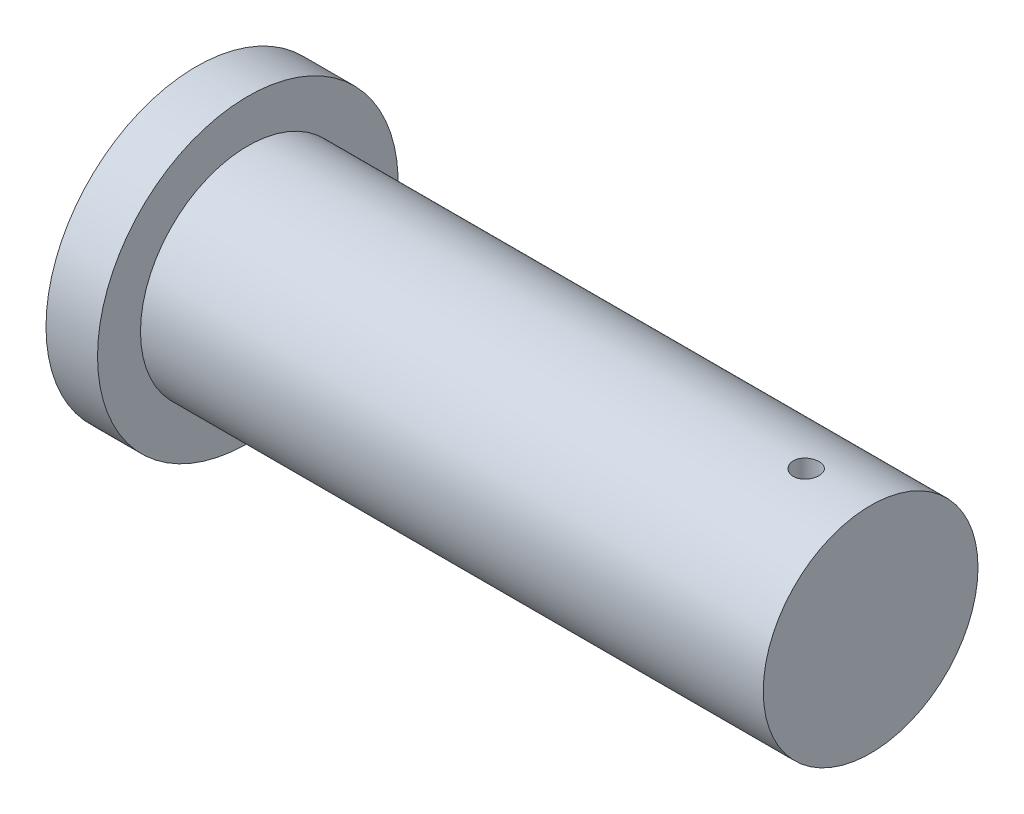
ISO-10303-21;
HEADER;
FILE_DESCRIPTION(('STEP AP214'),'2;1');
FILE_NAME('part.step','',(''),(''),'','','');
FILE_SCHEMA(('AUTOMOTIVE_DESIGN { 1 0 10303 214 1 1 1 1 }'));
ENDSEC;
DATA;
#1=APPLICATION_CONTEXT('core data for automotive mechanical design processes');
#2=APPLICATION_PROTOCOL_DEFINITION('international standard','automotive_design',2000,#1);
#3=PRODUCT_CONTEXT('',#1,'mechanical');
#4=PRODUCT('Part','Part','',(#3));
#5=PRODUCT_RELATED_PRODUCT_CATEGORY('part','',(#4));
#6=PRODUCT_DEFINITION_FORMATION('','',#4);
#7=PRODUCT_DEFINITION_CONTEXT('part definition',#1,'design');
#8=PRODUCT_DEFINITION('design','',#6,#7);
#9=PRODUCT_DEFINITION_SHAPE('','',#8);
#10=(LENGTH_UNIT() NAMED_UNIT(*) SI_UNIT(.MILLI.,.METRE.));
#11=(NAMED_UNIT(*) PLANE_ANGLE_UNIT() SI_UNIT($,.RADIAN.));
#12=(NAMED_UNIT(*) SI_UNIT($,.STERADIAN.) SOLID_ANGLE_UNIT());
#13=UNCERTAINTY_MEASURE_WITH_UNIT(LENGTH_MEASURE(1.E-05),#10,'distance_accuracy_value','');
#14=(GEOMETRIC_REPRESENTATION_CONTEXT(3) GLOBAL_UNCERTAINTY_ASSIGNED_CONTEXT((#13)) GLOBAL_UNIT_ASSIGNED_CONTEXT((#10,
#11,#12)) REPRESENTATION_CONTEXT('',''));
#15=CARTESIAN_POINT('',(0.,0.,0.));
#16=DIRECTION('',(0.,0.,1.));
#17=DIRECTION('',(1.,0.,0.));
#18=AXIS2_PLACEMENT_3D('',#15,#16,#17);
#19=CARTESIAN_POINT('',(0.,0.,0.));
#20=DIRECTION('',(-1.,0.,0.));
#21=DIRECTION('',(0.,0.,1.));
#22=AXIS2_PLACEMENT_3D('',#19,#20,#21);
#23=PLANE('',#22);
#24=CARTESIAN_POINT('',(0.,0.,0.));
#25=DIRECTION('',(-1.,0.,0.));
#26=DIRECTION('',(0.,0.,1.));
#27=AXIS2_PLACEMENT_3D('',#24,#25,#26);
#28=CIRCLE('',#27,250.);
#29=CARTESIAN_POINT('',(0.,0.,250.));
#30=VERTEX_POINT('',#29);
#31=EDGE_CURVE('E10',#30,#30,#28,.T.);
#32=ORIENTED_EDGE('',*,*,#31,.F.);
#33=EDGE_LOOP('',(#32));
#34=FACE_BOUND('',#33,.T.);
#35=ADVANCED_FACE('F37',(#34),#23,.F.);
#36=CARTESIAN_POINT('',(-1570.,0.,0.));
#37=DIRECTION('',(-1.,0.,0.));
#38=DIRECTION('',(0.,0.,1.));
#39=AXIS2_PLACEMENT_3D('',#36,#37,#38);
#40=CYLINDRICAL_SURFACE('',#39,250.);
#41=CARTESIAN_POINT('',(-150.,-248.193472919817,30.));
#42=CARTESIAN_POINT('',(-149.1605704413,-248.193474531631,29.9999946509676));
#43=CARTESIAN_POINT('',(-148.320999975533,-248.197743080728,29.9647376822216));
#44=CARTESIAN_POINT('',(-146.647741109354,-248.214699920192,29.8239438039664));
#45=CARTESIAN_POINT('',(-145.814054103793,-248.2273901436,29.7183907592619));
#46=CARTESIAN_POINT('',(-144.157803445657,-248.260840976248,29.437643248266));
#47=CARTESIAN_POINT('',(-143.335251360894,-248.28160939787,29.2623813632194));
#48=CARTESIAN_POINT('',(-141.708019820902,-248.330617331352,28.8435242149326));
#49=CARTESIAN_POINT('',(-140.903339348547,-248.358856416848,28.5999328513345));
#50=CARTESIAN_POINT('',(-139.317998086867,-248.421976036118,28.0463777739689));
#51=CARTESIAN_POINT('',(-138.53732207594,-248.456852255905,27.7364571564889));
#52=CARTESIAN_POINT('',(-137.004911431408,-248.532264669028,27.0523889546609));
#53=CARTESIAN_POINT('',(-136.253177185404,-248.572800938131,26.6782405105099));
#54=CARTESIAN_POINT('',(-134.784038367413,-248.658375561636,25.8684731554346));
#55=CARTESIAN_POINT('',(-134.066627306623,-248.703413060068,25.4328659252837));
#56=CARTESIAN_POINT('',(-132.6709543014,-248.796726113069,24.5032084370155));
#57=CARTESIAN_POINT('',(-131.992692378886,-248.845001669451,24.0091581461777));
#58=CARTESIAN_POINT('',(-130.676969930708,-248.943662426129,22.9636627490856));
#59=CARTESIAN_POINT('',(-130.039712237698,-248.994056337376,22.4119631888764));
#60=CARTESIAN_POINT('',(-128.813877743625,-249.095320238186,21.2569381320288));
#61=CARTESIAN_POINT('',(-128.225301123888,-249.146190229521,20.6536124431132));
#62=CARTESIAN_POINT('',(-127.100916607426,-249.24697467363,19.3995169953124));
#63=CARTESIAN_POINT('',(-126.565111252273,-249.296889080287,18.7487449539387));
#64=CARTESIAN_POINT('',(-125.550068542811,-249.394354081313,17.4043184562741));
#65=CARTESIAN_POINT('',(-125.070831226376,-249.441904674099,16.7106639712729));
#66=CARTESIAN_POINT('',(-124.170950368469,-249.533442144995,15.283136535881));
#67=CARTESIAN_POINT('',(-123.750490049984,-249.577417708061,14.5491473403797));
#68=CARTESIAN_POINT('',(-122.972931747199,-249.6603951477,13.0480665588376));
#69=CARTESIAN_POINT('',(-122.615833933811,-249.699397010857,12.2809748835136));
#70=CARTESIAN_POINT('',(-121.967613733338,-249.771317118663,10.7191496279362));
#71=CARTESIAN_POINT('',(-121.67648957869,-249.804235526295,9.92441678890158));
#72=CARTESIAN_POINT('',(-121.162352645447,-249.863051734217,8.31296355266619));
#73=CARTESIAN_POINT('',(-120.9393395157,-249.888949570703,7.49624326884762));
#74=CARTESIAN_POINT('',(-120.563993792491,-249.932878697725,5.8506665836714));
#75=CARTESIAN_POINT('',(-120.411324978212,-249.950947383566,5.02188786360801));
#76=CARTESIAN_POINT('',(-120.17622148034,-249.978887329081,3.35429051231377));
#77=CARTESIAN_POINT('',(-120.093786593924,-249.988758612427,2.5154719100833));
#78=CARTESIAN_POINT('',(-119.999768971145,-250.000023346581,0.833843716313003));
#79=CARTESIAN_POINT('',(-119.988183947642,-250.001417071057,-0.00896574551689192));
#80=CARTESIAN_POINT('',(-120.035946972574,-249.995687792436,-1.69254185793251));
#81=CARTESIAN_POINT('',(-120.095294826074,-249.988564812744,-2.53330851412584));
#82=CARTESIAN_POINT('',(-120.283990236561,-249.966062777657,-4.20244453023435));
#83=CARTESIAN_POINT('',(-120.412975601989,-249.950726444014,-5.03085544328965));
#84=CARTESIAN_POINT('',(-120.73975635101,-249.9122557387,-6.67380360362));
#85=CARTESIAN_POINT('',(-120.93755145992,-249.889121398159,-7.48834090626358));
#86=CARTESIAN_POINT('',(-121.40050574512,-249.83570252719,-9.09780852968847));
#87=CARTESIAN_POINT('',(-121.665665751094,-249.805417908697,-9.89273860884935));
#88=CARTESIAN_POINT('',(-122.261425636984,-249.738545201862,-11.4574117372028));
#89=CARTESIAN_POINT('',(-122.59202576275,-249.701957089838,-12.2271546917577));
#90=CARTESIAN_POINT('',(-123.317195071912,-249.623400157603,-13.7379683316622));
#91=CARTESIAN_POINT('',(-123.711921271942,-249.581418184343,-14.4789629635211));
#92=CARTESIAN_POINT('',(-124.561941982507,-249.493318926867,-15.9250956040533));
#93=CARTESIAN_POINT('',(-125.017236556642,-249.447201638309,-16.6302335750746));
#94=CARTESIAN_POINT('',(-125.985201132959,-249.352117841448,-17.9997951231493));
#95=CARTESIAN_POINT('',(-126.497873181545,-249.303151231553,-18.664217246737));
#96=CARTESIAN_POINT('',(-127.576998276152,-249.203736816779,-19.9477312714738));
#97=CARTESIAN_POINT('',(-128.143451560363,-249.153289005341,-20.5668229718397));
#98=CARTESIAN_POINT('',(-129.329940664582,-249.052002372002,-21.7591461132143));
#99=CARTESIAN_POINT('',(-129.950291858021,-249.001163090519,-22.3320637323763));
#100=CARTESIAN_POINT('',(-131.23713401272,-248.900851276313,-23.4236363437972));
#101=CARTESIAN_POINT('',(-131.903625179866,-248.851378749691,-23.9422910938981));
#102=CARTESIAN_POINT('',(-133.278087670693,-248.755205933452,-24.9216719052182));
#103=CARTESIAN_POINT('',(-133.986059213002,-248.708505658448,-25.3823976610738));
#104=CARTESIAN_POINT('',(-135.438514856123,-248.619209908325,-26.2426285291918));
#105=CARTESIAN_POINT('',(-136.18299889198,-248.576614425904,-26.6421337503589));
#106=CARTESIAN_POINT('',(-137.703527308154,-248.496733797357,-27.3771821116765));
#107=CARTESIAN_POINT('',(-138.47958355691,-248.459450672381,-27.7127009237719));
#108=CARTESIAN_POINT('',(-140.057489994014,-248.391288696872,-28.3171374504508));
#109=CARTESIAN_POINT('',(-140.859340207393,-248.360409852555,-28.5860551003969));
#110=CARTESIAN_POINT('',(-142.483080291291,-248.305951958708,-29.0552932977666));
#111=CARTESIAN_POINT('',(-143.304969434112,-248.282372644526,-29.255616332184));
#112=CARTESIAN_POINT('',(-144.96290865867,-248.243198383256,-29.5861827187821));
#113=CARTESIAN_POINT('',(-145.798958662777,-248.227603392413,-29.716426455005));
#114=CARTESIAN_POINT('',(-147.473953016257,-248.204923432622,-29.9052668310815));
#115=CARTESIAN_POINT('',(-148.312846991056,-248.197786118229,-29.9643042155057));
#116=CARTESIAN_POINT('',(-149.992657619704,-248.192051927075,-30.0117633896308));
#117=CARTESIAN_POINT('',(-150.8335742652,-248.193455015103,-30.0001854704649));
#118=CARTESIAN_POINT('',(-152.511395065306,-248.204760956533,-29.9065018038126));
#119=CARTESIAN_POINT('',(-153.348299294855,-248.214663650566,-29.8243973787052));
#120=CARTESIAN_POINT('',(-155.012129982595,-248.242682732508,-29.5902743976899));
#121=CARTESIAN_POINT('',(-155.839056445804,-248.260799116285,-29.4382558769449));
#122=CARTESIAN_POINT('',(-157.474502965534,-248.304655640846,-29.0660101429271));
#123=CARTESIAN_POINT('',(-158.283072119113,-248.330371983227,-28.8459957539828));
#124=CARTESIAN_POINT('',(-159.878751686147,-248.388715473606,-28.3392134881515));
#125=CARTESIAN_POINT('',(-160.665862159057,-248.421342602454,-28.0524457962345));
#126=CARTESIAN_POINT('',(-162.213143298547,-248.492582429562,-27.4142208538501));
#127=CARTESIAN_POINT('',(-162.973313286559,-248.531195278457,-27.062761975343));
#128=CARTESIAN_POINT('',(-164.461416251638,-248.613315286474,-26.2976691995083));
#129=CARTESIAN_POINT('',(-165.189349066541,-248.656822470213,-25.8840349894648));
#130=CARTESIAN_POINT('',(-166.611408771142,-248.747729364898,-24.9953500062539));
#131=CARTESIAN_POINT('',(-167.305353560671,-248.795147017641,-24.5200096625206));
#132=CARTESIAN_POINT('',(-168.650792269959,-248.892349734088,-23.5128496840407));
#133=CARTESIAN_POINT('',(-169.302286068319,-248.94213480456,-22.9810298877921));
#134=CARTESIAN_POINT('',(-170.558322824153,-249.042672336284,-21.8646149255231));
#135=CARTESIAN_POINT('',(-171.162864296291,-249.093424828075,-21.2800180911685));
#136=CARTESIAN_POINT('',(-172.320773332466,-249.194470611332,-20.0621306020361));
#137=CARTESIAN_POINT('',(-172.874140753962,-249.244763901518,-19.4288398116353));
#138=CARTESIAN_POINT('',(-173.928599123128,-249.343740229315,-18.1145159166704));
#139=CARTESIAN_POINT('',(-174.429400510761,-249.392413432178,-17.433249721657));
#140=CARTESIAN_POINT('',(-175.371826218618,-249.486491898318,-16.0307281687418));
#141=CARTESIAN_POINT('',(-175.813450300065,-249.531897148409,-15.3094726495014));
#142=CARTESIAN_POINT('',(-176.634344274995,-249.618151591168,-13.8320586111139));
#143=CARTESIAN_POINT('',(-177.013614990501,-249.659000843896,-13.0759005522647));
#144=CARTESIAN_POINT('',(-177.707054443502,-249.734983564515,-11.5340229887521));
#145=CARTESIAN_POINT('',(-178.021223433973,-249.770117054615,-10.7483035989737));
#146=CARTESIAN_POINT('',(-178.581451853234,-249.833588745784,-9.15489098903917));
#147=CARTESIAN_POINT('',(-178.827679671532,-249.861943723365,-8.34725764502255));
#148=CARTESIAN_POINT('',(-179.251245916454,-249.911166395072,-6.71389777364353));
#149=CARTESIAN_POINT('',(-179.428584416741,-249.932034097204,-5.88817126562875));
#150=CARTESIAN_POINT('',(-179.713045056139,-249.965687778844,-4.22457629840832));
#151=CARTESIAN_POINT('',(-179.820169630992,-249.9784740387,-3.38670826142659));
#152=CARTESIAN_POINT('',(-179.96340788777,-249.99560143016,-1.70483954433616));
#153=CARTESIAN_POINT('',(-179.999521891187,-249.999942599999,-0.860838892009534));
#154=CARTESIAN_POINT('',(-180.000465701341,-250.000055910935,0.821891060714141));
#155=CARTESIAN_POINT('',(-179.965742246484,-249.995881754181,1.66062014165989));
#156=CARTESIAN_POINT('',(-179.826166823084,-249.979190014585,3.33213559205108));
#157=CARTESIAN_POINT('',(-179.721315169328,-249.966672469195,4.16492198815463));
#158=CARTESIAN_POINT('',(-179.442260953022,-249.933646334168,5.81862750164886));
#159=CARTESIAN_POINT('',(-179.268058587309,-249.913137767213,6.63954665271501));
#160=CARTESIAN_POINT('',(-178.85158524623,-249.86470587868,8.26370804760723));
#161=CARTESIAN_POINT('',(-178.609314148308,-249.836782543753,9.06695025960339));
#162=CARTESIAN_POINT('',(-178.058554843599,-249.774313586065,10.6498604352753));
#163=CARTESIAN_POINT('',(-177.750086724313,-249.739769972569,11.4295354687165));
#164=CARTESIAN_POINT('',(-177.069115802718,-249.665020719012,12.960114678435));
#165=CARTESIAN_POINT('',(-176.696613049426,-249.624815083284,13.7110188767354));
#166=CARTESIAN_POINT('',(-175.890228843372,-249.539863095647,15.1788419699795));
#167=CARTESIAN_POINT('',(-175.456347346031,-249.495116740438,15.8957608402394));
#168=CARTESIAN_POINT('',(-174.530265194195,-249.402329067066,17.2906605810802));
#169=CARTESIAN_POINT('',(-174.038064289256,-249.354287734752,17.9686412844272));
#170=CARTESIAN_POINT('',(-172.995639159189,-249.255950077794,19.2849594194555));
#171=CARTESIAN_POINT('',(-172.445082438354,-249.205641885906,19.923032680102));
#172=CARTESIAN_POINT('',(-171.292280176236,-249.104459244391,21.1505976868385));
#173=CARTESIAN_POINT('',(-170.690034250122,-249.053584790551,21.7400890711682));
#174=CARTESIAN_POINT('',(-169.437907579956,-248.952691992913,22.8665055592455));
#175=CARTESIAN_POINT('',(-168.788015340804,-248.902673859324,23.4034179043673));
#176=CARTESIAN_POINT('',(-167.44526388913,-248.804921545612,24.4207336954875));
#177=CARTESIAN_POINT('',(-166.752405246466,-248.757187335214,24.9011378907015));
#178=CARTESIAN_POINT('',(-165.326017000733,-248.665193713503,25.8036432950789));
#179=CARTESIAN_POINT('',(-164.592351663176,-248.620947248293,26.2255313287722));
#180=CARTESIAN_POINT('',(-163.091732249698,-248.537386184943,27.0059583921024));
#181=CARTESIAN_POINT('',(-162.324776130025,-248.498071890171,27.3644935255784));
#182=CARTESIAN_POINT('',(-160.763871473165,-248.425549653007,28.0152351882781));
#183=CARTESIAN_POINT('',(-159.969950899548,-248.392335600441,28.3075081571224));
#184=CARTESIAN_POINT('',(-158.36013899519,-248.332932727422,28.8239875750066));
#185=CARTESIAN_POINT('',(-157.544252946941,-248.306742234185,29.0482102331036));
#186=CARTESIAN_POINT('',(-156.16999327754,-248.269542249127,29.3640997551931));
#187=CARTESIAN_POINT('',(-155.616030955531,-248.256379293141,29.4750618477914));
#188=CARTESIAN_POINT('',(-154.502667838974,-248.233689152617,29.6655497040171));
#189=CARTESIAN_POINT('',(-153.943267497728,-248.224161667652,29.7450780652627));
#190=CARTESIAN_POINT('',(-152.82076790437,-248.208867224382,29.8724346728726));
#191=CARTESIAN_POINT('',(-152.257668326194,-248.203100602191,29.9202600859007));
#192=CARTESIAN_POINT('',(-151.129733640302,-248.195403114445,29.9840428305316));
#193=CARTESIAN_POINT('',(-150.564898726378,-248.193471835138,30.0000035996607));
#194=CARTESIAN_POINT('',(-150.,-248.193472919817,30.));
#195=B_SPLINE_CURVE_WITH_KNOTS('',3,(#41,#42,#43,#44,#45,#46,#47,#48,#49,#50,#51,#52,#53,#54,
#55,#56,#57,#58,#59,#60,#61,#62,#63,#64,#65,#66,#67,#68,#69,#70,#71,#72,#73,#74,#75,#76,#77,#78,
#79,#80,#81,#82,#83,#84,#85,#86,#87,#88,#89,#90,#91,#92,#93,#94,#95,#96,#97,#98,#99,#100,#101,
#102,#103,#104,#105,#106,#107,#108,#109,#110,#111,#112,#113,#114,#115,#116,#117,#118,#119,#120,
#121,#122,#123,#124,#125,#126,#127,#128,#129,#130,#131,#132,#133,#134,#135,#136,#137,#138,#139,
#140,#141,#142,#143,#144,#145,#146,#147,#148,#149,#150,#151,#152,#153,#154,#155,#156,#157,#158,
#159,#160,#161,#162,#163,#164,#165,#166,#167,#168,#169,#170,#171,#172,#173,#174,#175,#176,#177,
#178,#179,#180,#181,#182,#183,#184,#185,#186,#187,#188,#189,#190,#191,#192,#193,#194),
.UNSPECIFIED.,.T.,.F.,(4,2,2,2,2,2,2,2,2,2,2,2,2,2,2,2,2,2,2,2,2,2,2,2,2,2,2,2,2,2,2,2,2,2,2,2,
2,2,2,2,2,2,2,2,2,2,2,2,2,2,2,2,2,2,2,2,2,2,2,2,2,2,2,2,2,2,2,2,2,2,2,2,2,2,2,2,4),(0.,
2.51778336120787,5.03614483340464,7.5569478791578,10.0776070890421,12.5966334893289,
15.1156936138648,17.6342756125914,20.1528590213977,22.6830704251219,25.2132912528273,
27.7436338815808,30.2739782044391,32.8120422932015,35.3501132279974,37.8881161549024,
40.4261059966501,42.9518359963828,45.4775587022602,48.0031998736002,50.5288341040817,
53.0414570607044,55.5540699872896,58.0667138614276,60.5793671754447,63.0982682651093,
65.6171719997426,68.1361656013437,70.6551703597175,73.190060359931,75.7249616720726,
78.2598763459937,80.7947865105238,83.3306585515194,85.8665330536023,88.4023156042651,
90.9380842584261,93.4580754143531,95.9780561808548,98.4979896984996,101.017921948763,
103.530045452468,106.042161995283,108.554341767491,111.06653417533,113.590973306469,
116.115419656387,118.639945834501,121.164479044206,123.702259810315,126.240050815944,
128.777808362505,131.315556047529,133.846956344173,136.378353934039,138.909663704341,
141.440962014409,143.956345976335,146.471718647479,148.987084179392,151.502454240218,
154.017062088027,156.531668010964,159.046275760263,161.560894308643,164.090700724772,
166.620525977165,169.150963593885,171.681367656906,174.220760623165,176.760309706082,
179.297301064822,181.833687656739,183.528215248704,185.222602779138,186.91714171891,
188.611497843615),.UNSPECIFIED.);
#196=CARTESIAN_POINT('',(-150.,-248.193472919817,30.));
#197=VERTEX_POINT('',#196);
#198=EDGE_CURVE('E40',#197,#197,#195,.T.);
#199=ORIENTED_EDGE('',*,*,#198,.T.);
#200=EDGE_LOOP('',(#199));
#201=FACE_BOUND('',#200,.T.);
#202=CARTESIAN_POINT('',(-150.,248.193472919817,30.));
#203=CARTESIAN_POINT('',(-150.8394295587,248.193474531631,29.9999946509676));
#204=CARTESIAN_POINT('',(-151.679000024467,248.197743080728,29.9647376822216));
#205=CARTESIAN_POINT('',(-153.352258890646,248.214699920192,29.8239438039664));
#206=CARTESIAN_POINT('',(-154.185945896208,248.2273901436,29.7183907592619));
#207=CARTESIAN_POINT('',(-155.842196554343,248.260840976248,29.437643248266));
#208=CARTESIAN_POINT('',(-156.664748639107,248.28160939787,29.2623813632194));
#209=CARTESIAN_POINT('',(-158.291980179099,248.330617331352,28.8435242149326));
#210=CARTESIAN_POINT('',(-159.096660651453,248.358856416848,28.5999328513345));
#211=CARTESIAN_POINT('',(-160.682001913133,248.421976036118,28.0463777739689));
#212=CARTESIAN_POINT('',(-161.46267792406,248.456852255905,27.7364571564889));
#213=CARTESIAN_POINT('',(-162.995088568592,248.532264669028,27.0523889546609));
#214=CARTESIAN_POINT('',(-163.746822814596,248.572800938131,26.6782405105099));
#215=CARTESIAN_POINT('',(-165.215961632587,248.658375561636,25.8684731554346));
#216=CARTESIAN_POINT('',(-165.933372693377,248.703413060068,25.4328659252837));
#217=CARTESIAN_POINT('',(-167.3290456986,248.796726113069,24.5032084370155));
#218=CARTESIAN_POINT('',(-168.007307621114,248.845001669451,24.0091581461777));
#219=CARTESIAN_POINT('',(-169.323030069292,248.943662426129,22.9636627490856));
#220=CARTESIAN_POINT('',(-169.960287762302,248.994056337376,22.4119631888764));
#221=CARTESIAN_POINT('',(-171.186122256375,249.095320238186,21.2569381320288));
#222=CARTESIAN_POINT('',(-171.774698876113,249.146190229521,20.6536124431132));
#223=CARTESIAN_POINT('',(-172.899083392575,249.24697467363,19.3995169953124));
#224=CARTESIAN_POINT('',(-173.434888747727,249.296889080287,18.7487449539387));
#225=CARTESIAN_POINT('',(-174.449931457189,249.394354081313,17.4043184562741));
#226=CARTESIAN_POINT('',(-174.929168773624,249.441904674099,16.7106639712729));
#227=CARTESIAN_POINT('',(-175.829049631531,249.533442144995,15.283136535881));
#228=CARTESIAN_POINT('',(-176.249509950016,249.577417708061,14.5491473403797));
#229=CARTESIAN_POINT('',(-177.027068252801,249.6603951477,13.0480665588376));
#230=CARTESIAN_POINT('',(-177.384166066189,249.699397010857,12.2809748835136));
#231=CARTESIAN_POINT('',(-178.032386266662,249.771317118663,10.7191496279363));
#232=CARTESIAN_POINT('',(-178.32351042131,249.804235526295,9.92441678890159));
#233=CARTESIAN_POINT('',(-178.837647354553,249.863051734217,8.31296355266619));
#234=CARTESIAN_POINT('',(-179.0606604843,249.888949570703,7.49624326884762));
#235=CARTESIAN_POINT('',(-179.436006207509,249.932878697725,5.8506665836714));
#236=CARTESIAN_POINT('',(-179.588675021788,249.950947383566,5.02188786360801));
#237=CARTESIAN_POINT('',(-179.823778519661,249.978887329081,3.35429051231377));
#238=CARTESIAN_POINT('',(-179.906213406076,249.988758612427,2.51547191008329));
#239=CARTESIAN_POINT('',(-180.000231028855,250.000023346581,0.833843716312995));
#240=CARTESIAN_POINT('',(-180.011816052358,250.001417071057,-0.00896574551689767));
#241=CARTESIAN_POINT('',(-179.964053027426,249.995687792436,-1.69254185793251));
#242=CARTESIAN_POINT('',(-179.904705173926,249.988564812744,-2.53330851412584));
#243=CARTESIAN_POINT('',(-179.71600976344,249.966062777657,-4.20244453023435));
#244=CARTESIAN_POINT('',(-179.587024398011,249.950726444014,-5.03085544328964));
#245=CARTESIAN_POINT('',(-179.26024364899,249.9122557387,-6.67380360361999));
#246=CARTESIAN_POINT('',(-179.06244854008,249.889121398159,-7.48834090626357));
#247=CARTESIAN_POINT('',(-178.599494254881,249.83570252719,-9.09780852968846));
#248=CARTESIAN_POINT('',(-178.334334248906,249.805417908697,-9.89273860884934));
#249=CARTESIAN_POINT('',(-177.738574363016,249.738545201862,-11.4574117372028));
#250=CARTESIAN_POINT('',(-177.40797423725,249.701957089838,-12.2271546917577));
#251=CARTESIAN_POINT('',(-176.682804928088,249.623400157603,-13.7379683316622));
#252=CARTESIAN_POINT('',(-176.288078728059,249.581418184343,-14.4789629635211));
#253=CARTESIAN_POINT('',(-175.438058017493,249.493318926867,-15.9250956040533));
#254=CARTESIAN_POINT('',(-174.982763443358,249.447201638309,-16.6302335750746));
#255=CARTESIAN_POINT('',(-174.014798867042,249.352117841448,-17.9997951231493));
#256=CARTESIAN_POINT('',(-173.502126818456,249.303151231553,-18.664217246737));
#257=CARTESIAN_POINT('',(-172.423001723848,249.203736816779,-19.9477312714738));
#258=CARTESIAN_POINT('',(-171.856548439638,249.153289005341,-20.5668229718397));
#259=CARTESIAN_POINT('',(-170.670059335418,249.052002372002,-21.7591461132143));
#260=CARTESIAN_POINT('',(-170.049708141979,249.001163090519,-22.3320637323763));
#261=CARTESIAN_POINT('',(-168.762865987281,248.900851276313,-23.4236363437972));
#262=CARTESIAN_POINT('',(-168.096374820134,248.851378749691,-23.9422910938981));
#263=CARTESIAN_POINT('',(-166.721912329307,248.755205933452,-24.9216719052182));
#264=CARTESIAN_POINT('',(-166.013940786998,248.708505658448,-25.3823976610738));
#265=CARTESIAN_POINT('',(-164.561485143877,248.619209908325,-26.2426285291918));
#266=CARTESIAN_POINT('',(-163.817001108021,248.576614425904,-26.6421337503589));
#267=CARTESIAN_POINT('',(-162.296472691847,248.496733797357,-27.3771821116765));
#268=CARTESIAN_POINT('',(-161.52041644309,248.459450672381,-27.7127009237719));
#269=CARTESIAN_POINT('',(-159.942510005987,248.391288696872,-28.3171374504508));
#270=CARTESIAN_POINT('',(-159.140659792607,248.360409852555,-28.5860551003969));
#271=CARTESIAN_POINT('',(-157.516919708709,248.305951958708,-29.0552932977666));
#272=CARTESIAN_POINT('',(-156.695030565888,248.282372644526,-29.255616332184));
#273=CARTESIAN_POINT('',(-155.037091341331,248.243198383256,-29.5861827187821));
#274=CARTESIAN_POINT('',(-154.201041337223,248.227603392413,-29.716426455005));
#275=CARTESIAN_POINT('',(-152.526046983743,248.204923432622,-29.9052668310815));
#276=CARTESIAN_POINT('',(-151.687153008944,248.197786118229,-29.9643042155057));
#277=CARTESIAN_POINT('',(-150.007342380296,248.192051927075,-30.0117633896308));
#278=CARTESIAN_POINT('',(-149.166425734801,248.193455015103,-30.0001854704649));
#279=CARTESIAN_POINT('',(-147.488604934694,248.204760956533,-29.9065018038126));
#280=CARTESIAN_POINT('',(-146.651700705145,248.214663650566,-29.8243973787052));
#281=CARTESIAN_POINT('',(-144.987870017405,248.242682732508,-29.5902743976899));
#282=CARTESIAN_POINT('',(-144.160943554197,248.260799116285,-29.4382558769449));
#283=CARTESIAN_POINT('',(-142.525497034467,248.304655640846,-29.0660101429271));
#284=CARTESIAN_POINT('',(-141.716927880887,248.330371983227,-28.8459957539828));
#285=CARTESIAN_POINT('',(-140.121248313853,248.388715473606,-28.3392134881515));
#286=CARTESIAN_POINT('',(-139.334137840943,248.421342602454,-28.0524457962345));
#287=CARTESIAN_POINT('',(-137.786856701454,248.492582429562,-27.4142208538501));
#288=CARTESIAN_POINT('',(-137.026686713441,248.531195278457,-27.062761975343));
#289=CARTESIAN_POINT('',(-135.538583748362,248.613315286474,-26.2976691995083));
#290=CARTESIAN_POINT('',(-134.810650933459,248.656822470213,-25.8840349894648));
#291=CARTESIAN_POINT('',(-133.388591228859,248.747729364898,-24.9953500062539));
#292=CARTESIAN_POINT('',(-132.694646439329,248.795147017641,-24.5200096625206));
#293=CARTESIAN_POINT('',(-131.349207730042,248.892349734088,-23.5128496840407));
#294=CARTESIAN_POINT('',(-130.697713931681,248.94213480456,-22.9810298877921));
#295=CARTESIAN_POINT('',(-129.441677175848,249.042672336284,-21.8646149255231));
#296=CARTESIAN_POINT('',(-128.837135703709,249.093424828075,-21.2800180911685));
#297=CARTESIAN_POINT('',(-127.679226667535,249.194470611332,-20.0621306020361));
#298=CARTESIAN_POINT('',(-127.125859246038,249.244763901518,-19.4288398116353));
#299=CARTESIAN_POINT('',(-126.071400876872,249.343740229315,-18.1145159166704));
#300=CARTESIAN_POINT('',(-125.57059948924,249.392413432178,-17.433249721657));
#301=CARTESIAN_POINT('',(-124.628173781383,249.486491898318,-16.0307281687418));
#302=CARTESIAN_POINT('',(-124.186549699936,249.531897148409,-15.3094726495014));
#303=CARTESIAN_POINT('',(-123.365655725005,249.618151591168,-13.8320586111139));
#304=CARTESIAN_POINT('',(-122.9863850095,249.659000843896,-13.0759005522647));
#305=CARTESIAN_POINT('',(-122.292945556498,249.734983564515,-11.5340229887521));
#306=CARTESIAN_POINT('',(-121.978776566027,249.770117054615,-10.7483035989737));
#307=CARTESIAN_POINT('',(-121.418548146766,249.833588745784,-9.15489098903916));
#308=CARTESIAN_POINT('',(-121.172320328468,249.861943723365,-8.34725764502254));
#309=CARTESIAN_POINT('',(-120.748754083546,249.911166395072,-6.71389777364353));
#310=CARTESIAN_POINT('',(-120.571415583259,249.932034097204,-5.88817126562876));
#311=CARTESIAN_POINT('',(-120.286954943861,249.965687778844,-4.22457629840833));
#312=CARTESIAN_POINT('',(-120.179830369009,249.9784740387,-3.38670826142659));
#313=CARTESIAN_POINT('',(-120.036592112231,249.99560143016,-1.70483954433615));
#314=CARTESIAN_POINT('',(-120.000478108813,249.999942599999,-0.860838892009528));
#315=CARTESIAN_POINT('',(-119.999534298659,250.000055910935,0.821891060714145));
#316=CARTESIAN_POINT('',(-120.034257753516,249.995881754181,1.66062014165989));
#317=CARTESIAN_POINT('',(-120.173833176916,249.979190014585,3.33213559205109));
#318=CARTESIAN_POINT('',(-120.278684830673,249.966672469195,4.16492198815464));
#319=CARTESIAN_POINT('',(-120.557739046978,249.933646334168,5.81862750164886));
#320=CARTESIAN_POINT('',(-120.731941412692,249.913137767213,6.63954665271501));
#321=CARTESIAN_POINT('',(-121.14841475377,249.86470587868,8.26370804760723));
#322=CARTESIAN_POINT('',(-121.390685851692,249.836782543753,9.0669502596034));
#323=CARTESIAN_POINT('',(-121.941445156402,249.774313586065,10.6498604352753));
#324=CARTESIAN_POINT('',(-122.249913275688,249.739769972569,11.4295354687165));
#325=CARTESIAN_POINT('',(-122.930884197282,249.665020719012,12.960114678435));
#326=CARTESIAN_POINT('',(-123.303386950574,249.624815083284,13.7110188767354));
#327=CARTESIAN_POINT('',(-124.109771156628,249.539863095647,15.1788419699796));
#328=CARTESIAN_POINT('',(-124.54365265397,249.495116740438,15.8957608402394));
#329=CARTESIAN_POINT('',(-125.469734805805,249.402329067066,17.2906605810802));
#330=CARTESIAN_POINT('',(-125.961935710744,249.354287734752,17.9686412844272));
#331=CARTESIAN_POINT('',(-127.004360840811,249.255950077794,19.2849594194556));
#332=CARTESIAN_POINT('',(-127.554917561647,249.205641885906,19.923032680102));
#333=CARTESIAN_POINT('',(-128.707719823765,249.104459244391,21.1505976868385));
#334=CARTESIAN_POINT('',(-129.309965749878,249.053584790551,21.7400890711682));
#335=CARTESIAN_POINT('',(-130.562092420044,248.952691992913,22.8665055592455));
#336=CARTESIAN_POINT('',(-131.211984659197,248.902673859324,23.4034179043673));
#337=CARTESIAN_POINT('',(-132.554736110871,248.804921545612,24.4207336954874));
#338=CARTESIAN_POINT('',(-133.247594753534,248.757187335214,24.9011378907016));
#339=CARTESIAN_POINT('',(-134.673982999268,248.665193713503,25.8036432950789));
#340=CARTESIAN_POINT('',(-135.407648336824,248.620947248293,26.2255313287722));
#341=CARTESIAN_POINT('',(-136.908267750303,248.537386184943,27.0059583921024));
#342=CARTESIAN_POINT('',(-137.675223869975,248.498071890171,27.3644935255784));
#343=CARTESIAN_POINT('',(-139.236128526835,248.425549653007,28.0152351882781));
#344=CARTESIAN_POINT('',(-140.030049100452,248.392335600441,28.3075081571224));
#345=CARTESIAN_POINT('',(-141.63986100481,248.332932727422,28.8239875750066));
#346=CARTESIAN_POINT('',(-142.455747053059,248.306742234185,29.0482102331036));
#347=CARTESIAN_POINT('',(-143.830006722461,248.269542249127,29.3640997551931));
#348=CARTESIAN_POINT('',(-144.383969044469,248.256379293141,29.4750618477914));
#349=CARTESIAN_POINT('',(-145.497332161026,248.233689152617,29.6655497040171));
#350=CARTESIAN_POINT('',(-146.056732502272,248.224161667652,29.7450780652627));
#351=CARTESIAN_POINT('',(-147.17923209563,248.208867224382,29.8724346728726));
#352=CARTESIAN_POINT('',(-147.742331673807,248.203100602191,29.9202600859007));
#353=CARTESIAN_POINT('',(-148.870266359699,248.195403114445,29.9840428305316));
#354=CARTESIAN_POINT('',(-149.435101273622,248.193471835138,30.0000035996607));
#355=CARTESIAN_POINT('',(-150.,248.193472919817,30.));
#356=B_SPLINE_CURVE_WITH_KNOTS('',3,(#202,#203,#204,#205,#206,#207,#208,#209,#210,#211,#212,
#213,#214,#215,#216,#217,#218,#219,#220,#221,#222,#223,#224,#225,#226,#227,#228,#229,#230,#231,
#232,#233,#234,#235,#236,#237,#238,#239,#240,#241,#242,#243,#244,#245,#246,#247,#248,#249,#250,
#251,#252,#253,#254,#255,#256,#257,#258,#259,#260,#261,#262,#263,#264,#265,#266,#267,#268,#269,
#270,#271,#272,#273,#274,#275,#276,#277,#278,#279,#280,#281,#282,#283,#284,#285,#286,#287,#288,
#289,#290,#291,#292,#293,#294,#295,#296,#297,#298,#299,#300,#301,#302,#303,#304,#305,#306,#307,
#308,#309,#310,#311,#312,#313,#314,#315,#316,#317,#318,#319,#320,#321,#322,#323,#324,#325,#326,
#327,#328,#329,#330,#331,#332,#333,#334,#335,#336,#337,#338,#339,#340,#341,#342,#343,#344,#345,
#346,#347,#348,#349,#350,#351,#352,#353,#354,#355),.UNSPECIFIED.,.T.,.F.,(4,2,2,2,2,2,2,2,2,2,2,
2,2,2,2,2,2,2,2,2,2,2,2,2,2,2,2,2,2,2,2,2,2,2,2,2,2,2,2,2,2,2,2,2,2,2,2,2,2,2,2,2,2,2,2,2,2,2,2,
2,2,2,2,2,2,2,2,2,2,2,2,2,2,2,2,2,4),(0.,2.51778336120793,5.03614483340467,7.55694787915783,
10.0776070890421,12.5966334893289,15.1156936138648,17.6342756125914,20.1528590213977,
22.6830704251219,25.2132912528273,27.7436338815808,30.2739782044391,32.8120422932015,
35.3501132279973,37.8881161549024,40.4261059966501,42.9518359963828,45.4775587022602,
48.0031998736002,50.5288341040817,53.0414570607044,55.5540699872896,58.0667138614276,
60.5793671754447,63.0982682651093,65.6171719997426,68.1361656013437,70.6551703597175,
73.190060359931,75.7249616720726,78.2598763459937,80.7947865105238,83.3306585515194,
85.8665330536023,88.4023156042651,90.9380842584261,93.4580754143531,95.9780561808548,
98.4979896984996,101.017921948763,103.530045452468,106.042161995283,108.554341767491,
111.06653417533,113.590973306469,116.115419656387,118.639945834501,121.164479044206,
123.702259810315,126.240050815944,128.777808362505,131.315556047529,133.846956344173,
136.378353934039,138.909663704341,141.440962014409,143.956345976335,146.471718647479,
148.987084179392,151.502454240218,154.017062088027,156.531668010964,159.046275760263,
161.560894308643,164.090700724771,166.620525977165,169.150963593885,171.681367656906,
174.220760623165,176.760309706082,179.297301064822,181.833687656739,183.528215248704,
185.222602779138,186.91714171891,188.611497843615),.UNSPECIFIED.);
#357=CARTESIAN_POINT('',(-150.,248.193472919817,30.));
#358=VERTEX_POINT('',#357);
#359=EDGE_CURVE('E58',#358,#358,#356,.T.);
#360=ORIENTED_EDGE('',*,*,#359,.T.);
#361=EDGE_LOOP('',(#360));
#362=FACE_BOUND('',#361,.T.);
#363=CARTESIAN_POINT('',(-1450.,0.,0.));
#364=DIRECTION('',(-1.,0.,0.));
#365=DIRECTION('',(0.,0.,1.));
#366=AXIS2_PLACEMENT_3D('',#363,#364,#365);
#367=CIRCLE('',#366,250.);
#368=CARTESIAN_POINT('',(-1450.,0.,250.));
#369=VERTEX_POINT('',#368);
#370=EDGE_CURVE('E49',#369,#369,#367,.T.);
#371=ORIENTED_EDGE('',*,*,#370,.F.);
#372=EDGE_LOOP('',(#371));
#373=FACE_BOUND('',#372,.T.);
#374=ORIENTED_EDGE('',*,*,#31,.T.);
#375=EDGE_LOOP('',(#374));
#376=FACE_BOUND('',#375,.T.);
#377=ADVANCED_FACE('F64',(#201,#362,#373,#376),#40,.T.);
#378=CARTESIAN_POINT('',(-1450.,250.,0.));
#379=DIRECTION('',(-1.,0.,0.));
#380=DIRECTION('',(0.,0.,1.));
#381=AXIS2_PLACEMENT_3D('',#378,#379,#380);
#382=PLANE('',#381);
#383=CARTESIAN_POINT('',(-1450.,0.,0.));
#384=DIRECTION('',(-1.,0.,0.));
#385=DIRECTION('',(0.,0.,1.));
#386=AXIS2_PLACEMENT_3D('',#383,#384,#385);
#387=CIRCLE('',#386,350.);
#388=CARTESIAN_POINT('',(-1450.,0.,350.));
#389=VERTEX_POINT('',#388);
#390=EDGE_CURVE('E55',#389,#389,#387,.T.);
#391=ORIENTED_EDGE('',*,*,#390,.F.);
#392=EDGE_LOOP('',(#391));
#393=FACE_BOUND('',#392,.T.);
#394=ORIENTED_EDGE('',*,*,#370,.T.);
#395=EDGE_LOOP('',(#394));
#396=FACE_BOUND('',#395,.T.);
#397=ADVANCED_FACE('F79',(#393,#396),#382,.F.);
#398=CARTESIAN_POINT('',(-1570.,0.,0.));
#399=DIRECTION('',(-1.,0.,0.));
#400=DIRECTION('',(0.,0.,1.));
#401=AXIS2_PLACEMENT_3D('',#398,#399,#400);
#402=CYLINDRICAL_SURFACE('',#401,350.);
#403=CARTESIAN_POINT('',(-1570.,0.,0.));
#404=DIRECTION('',(-1.,0.,0.));
#405=DIRECTION('',(0.,0.,1.));
#406=AXIS2_PLACEMENT_3D('',#403,#404,#405);
#407=CIRCLE('',#406,350.);
#408=CARTESIAN_POINT('',(-1570.,0.,350.));
#409=VERTEX_POINT('',#408);
#410=EDGE_CURVE('E130',#409,#409,#407,.T.);
#411=ORIENTED_EDGE('',*,*,#410,.F.);
#412=EDGE_LOOP('',(#411));
#413=FACE_BOUND('',#412,.T.);
#414=ORIENTED_EDGE('',*,*,#390,.T.);
#415=EDGE_LOOP('',(#414));
#416=FACE_BOUND('',#415,.T.);
#417=ADVANCED_FACE('F76',(#413,#416),#402,.T.);
#418=CARTESIAN_POINT('',(-1570.,350.,0.));
#419=DIRECTION('',(1.,0.,0.));
#420=DIRECTION('',(0.,0.,-1.));
#421=AXIS2_PLACEMENT_3D('',#418,#419,#420);
#422=PLANE('',#421);
#423=ORIENTED_EDGE('',*,*,#410,.T.);
#424=EDGE_LOOP('',(#423));
#425=FACE_BOUND('',#424,.T.);
#426=ADVANCED_FACE('F71',(#425),#422,.F.);
#427=CARTESIAN_POINT('',(-150.,-350.,0.));
#428=DIRECTION('',(0.,1.,0.));
#429=DIRECTION('',(0.,0.,1.));
#430=AXIS2_PLACEMENT_3D('',#427,#428,#429);
#431=CYLINDRICAL_SURFACE('',#430,30.);
#432=ORIENTED_EDGE('',*,*,#359,.F.);
#433=EDGE_LOOP('',(#432));
#434=FACE_BOUND('',#433,.T.);
#435=ORIENTED_EDGE('',*,*,#198,.F.);
#436=EDGE_LOOP('',(#435));
#437=FACE_BOUND('',#436,.T.);
#438=ADVANCED_FACE('F67',(#434,#437),#431,.F.);
#439=CLOSED_SHELL('',(#35,#377,#397,#417,#426,#438));
#440=MANIFOLD_SOLID_BREP('B2',#439);
#441=ADVANCED_BREP_SHAPE_REPRESENTATION('',(#18,#440),#14);
#442=SHAPE_DEFINITION_REPRESENTATION(#9,#441);
ENDSEC;
END-ISO-10303-21;
